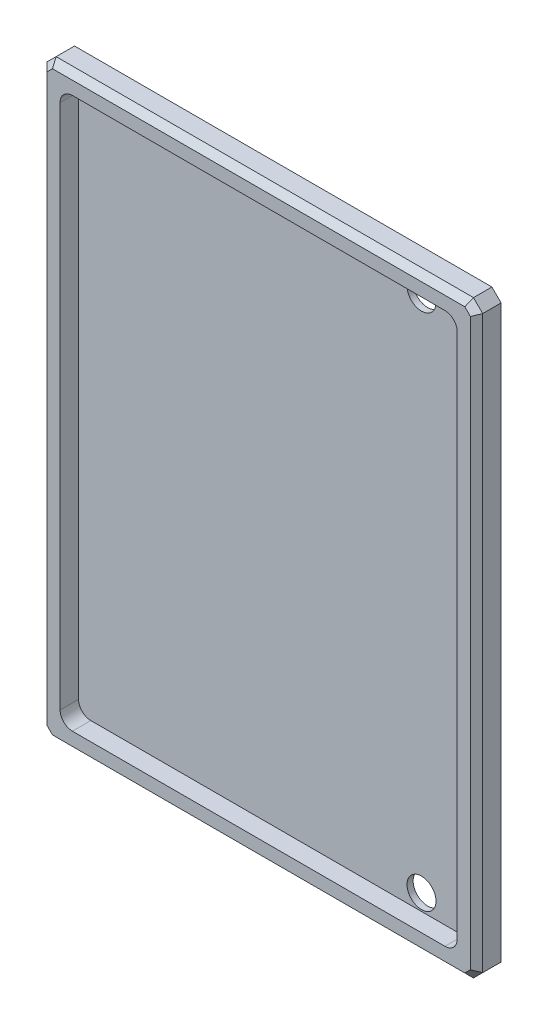
ISO-10303-21;
HEADER;
FILE_DESCRIPTION(('STEP AP214'),'2;1');
FILE_NAME('part.step','',(''),(''),'','','');
FILE_SCHEMA(('AUTOMOTIVE_DESIGN { 1 0 10303 214 1 1 1 1 }'));
ENDSEC;
DATA;
#1=APPLICATION_CONTEXT('core data for automotive mechanical design processes');
#2=APPLICATION_PROTOCOL_DEFINITION('international standard','automotive_design',2000,#1);
#3=PRODUCT_CONTEXT('',#1,'mechanical');
#4=PRODUCT('Part','Part','',(#3));
#5=PRODUCT_RELATED_PRODUCT_CATEGORY('part','',(#4));
#6=PRODUCT_DEFINITION_FORMATION('','',#4);
#7=PRODUCT_DEFINITION_CONTEXT('part definition',#1,'design');
#8=PRODUCT_DEFINITION('design','',#6,#7);
#9=PRODUCT_DEFINITION_SHAPE('','',#8);
#10=(LENGTH_UNIT() NAMED_UNIT(*) SI_UNIT(.MILLI.,.METRE.));
#11=(NAMED_UNIT(*) PLANE_ANGLE_UNIT() SI_UNIT($,.RADIAN.));
#12=(NAMED_UNIT(*) SI_UNIT($,.STERADIAN.) SOLID_ANGLE_UNIT());
#13=UNCERTAINTY_MEASURE_WITH_UNIT(LENGTH_MEASURE(1.E-05),#10,'distance_accuracy_value','');
#14=(GEOMETRIC_REPRESENTATION_CONTEXT(3) GLOBAL_UNCERTAINTY_ASSIGNED_CONTEXT((#13)) GLOBAL_UNIT_ASSIGNED_CONTEXT((#10,
#11,#12)) REPRESENTATION_CONTEXT('',''));
#15=CARTESIAN_POINT('',(0.,0.,0.));
#16=DIRECTION('',(0.,0.,1.));
#17=DIRECTION('',(1.,0.,0.));
#18=AXIS2_PLACEMENT_3D('',#15,#16,#17);
#19=CARTESIAN_POINT('',(-112.7125,-152.4,12.7));
#20=DIRECTION('',(1.,0.,0.));
#21=DIRECTION('',(0.,0.,-1.));
#22=AXIS2_PLACEMENT_3D('',#19,#20,#21);
#23=PLANE('',#22);
#24=DIRECTION('',(0.,0.,1.));
#25=VECTOR('',#24,1.);
#26=CARTESIAN_POINT('',(-112.7125,-147.6375,12.7));
#27=LINE('',#26,#25);
#28=CARTESIAN_POINT('',(-112.7125,-147.6375,0.));
#29=VERTEX_POINT('',#28);
#30=CARTESIAN_POINT('',(-112.7125,-147.6375,9.52499999999996));
#31=VERTEX_POINT('',#30);
#32=EDGE_CURVE('E289',#29,#31,#27,.T.);
#33=ORIENTED_EDGE('',*,*,#32,.T.);
#34=DIRECTION('',(0.,1.,0.));
#35=VECTOR('',#34,1.);
#36=CARTESIAN_POINT('',(-112.7125,147.6375,9.52499999999996));
#37=LINE('',#36,#35);
#38=CARTESIAN_POINT('',(-112.7125,147.6375,9.52499999999996));
#39=VERTEX_POINT('',#38);
#40=EDGE_CURVE('E347',#31,#39,#37,.T.);
#41=ORIENTED_EDGE('',*,*,#40,.T.);
#42=DIRECTION('',(0.,0.,-1.));
#43=VECTOR('',#42,1.);
#44=CARTESIAN_POINT('',(-112.7125,147.6375,12.7));
#45=LINE('',#44,#43);
#46=CARTESIAN_POINT('',(-112.7125,147.6375,0.));
#47=VERTEX_POINT('',#46);
#48=EDGE_CURVE('E295',#39,#47,#45,.T.);
#49=ORIENTED_EDGE('',*,*,#48,.T.);
#50=DIRECTION('',(0.,-1.,0.));
#51=VECTOR('',#50,1.);
#52=CARTESIAN_POINT('',(-112.7125,-152.4,0.));
#53=LINE('',#52,#51);
#54=EDGE_CURVE('E263',#47,#29,#53,.T.);
#55=ORIENTED_EDGE('',*,*,#54,.T.);
#56=EDGE_LOOP('',(#33,#41,#49,#55));
#57=FACE_BOUND('',#56,.T.);
#58=ADVANCED_FACE('F41',(#57),#23,.F.);
#59=CARTESIAN_POINT('',(112.7125,-152.4,12.7));
#60=DIRECTION('',(0.,1.,0.));
#61=DIRECTION('',(0.,0.,1.));
#62=AXIS2_PLACEMENT_3D('',#59,#60,#61);
#63=PLANE('',#62);
#64=DIRECTION('',(0.,0.,1.));
#65=VECTOR('',#64,1.);
#66=CARTESIAN_POINT('',(107.95,-152.4,12.7));
#67=LINE('',#66,#65);
#68=CARTESIAN_POINT('',(107.95,-152.4,0.));
#69=VERTEX_POINT('',#68);
#70=CARTESIAN_POINT('',(107.95,-152.4,9.52499999999996));
#71=VERTEX_POINT('',#70);
#72=EDGE_CURVE('E317',#69,#71,#67,.T.);
#73=ORIENTED_EDGE('',*,*,#72,.T.);
#74=DIRECTION('',(-1.,0.,0.));
#75=VECTOR('',#74,1.);
#76=CARTESIAN_POINT('',(-107.95,-152.4,9.52499999999996));
#77=LINE('',#76,#75);
#78=CARTESIAN_POINT('',(-107.95,-152.4,9.52499999999996));
#79=VERTEX_POINT('',#78);
#80=EDGE_CURVE('E11',#71,#79,#77,.T.);
#81=ORIENTED_EDGE('',*,*,#80,.T.);
#82=DIRECTION('',(0.,0.,-1.));
#83=VECTOR('',#82,1.);
#84=CARTESIAN_POINT('',(-107.95,-152.4,12.7));
#85=LINE('',#84,#83);
#86=CARTESIAN_POINT('',(-107.95,-152.4,0.));
#87=VERTEX_POINT('',#86);
#88=EDGE_CURVE('E315',#79,#87,#85,.T.);
#89=ORIENTED_EDGE('',*,*,#88,.T.);
#90=DIRECTION('',(1.,0.,0.));
#91=VECTOR('',#90,1.);
#92=CARTESIAN_POINT('',(112.7125,-152.4,0.));
#93=LINE('',#92,#91);
#94=EDGE_CURVE('E280',#87,#69,#93,.T.);
#95=ORIENTED_EDGE('',*,*,#94,.T.);
#96=EDGE_LOOP('',(#73,#81,#89,#95));
#97=FACE_BOUND('',#96,.T.);
#98=ADVANCED_FACE('F401',(#97),#63,.F.);
#99=CARTESIAN_POINT('',(112.7125,-152.4,12.7));
#100=DIRECTION('',(-1.,0.,0.));
#101=DIRECTION('',(0.,0.,1.));
#102=AXIS2_PLACEMENT_3D('',#99,#100,#101);
#103=PLANE('',#102);
#104=DIRECTION('',(0.,0.,1.));
#105=VECTOR('',#104,1.);
#106=CARTESIAN_POINT('',(112.7125,147.6375,12.7));
#107=LINE('',#106,#105);
#108=CARTESIAN_POINT('',(112.7125,147.6375,0.));
#109=VERTEX_POINT('',#108);
#110=CARTESIAN_POINT('',(112.7125,147.6375,9.52499999999996));
#111=VERTEX_POINT('',#110);
#112=EDGE_CURVE('E312',#109,#111,#107,.T.);
#113=ORIENTED_EDGE('',*,*,#112,.T.);
#114=DIRECTION('',(0.,-1.,0.));
#115=VECTOR('',#114,1.);
#116=CARTESIAN_POINT('',(112.7125,-147.6375,9.52499999999996));
#117=LINE('',#116,#115);
#118=CARTESIAN_POINT('',(112.7125,-147.6375,9.52499999999996));
#119=VERTEX_POINT('',#118);
#120=EDGE_CURVE('E339',#111,#119,#117,.T.);
#121=ORIENTED_EDGE('',*,*,#120,.T.);
#122=DIRECTION('',(0.,0.,-1.));
#123=VECTOR('',#122,1.);
#124=CARTESIAN_POINT('',(112.7125,-147.6375,12.7));
#125=LINE('',#124,#123);
#126=CARTESIAN_POINT('',(112.7125,-147.6375,0.));
#127=VERTEX_POINT('',#126);
#128=EDGE_CURVE('E310',#119,#127,#125,.T.);
#129=ORIENTED_EDGE('',*,*,#128,.T.);
#130=DIRECTION('',(0.,1.,0.));
#131=VECTOR('',#130,1.);
#132=CARTESIAN_POINT('',(112.7125,-152.4,0.));
#133=LINE('',#132,#131);
#134=EDGE_CURVE('E283',#127,#109,#133,.T.);
#135=ORIENTED_EDGE('',*,*,#134,.T.);
#136=EDGE_LOOP('',(#113,#121,#129,#135));
#137=FACE_BOUND('',#136,.T.);
#138=ADVANCED_FACE('F444',(#137),#103,.F.);
#139=CARTESIAN_POINT('',(112.7125,152.4,12.7));
#140=DIRECTION('',(0.,-1.,0.));
#141=DIRECTION('',(0.,0.,-1.));
#142=AXIS2_PLACEMENT_3D('',#139,#140,#141);
#143=PLANE('',#142);
#144=DIRECTION('',(0.,0.,1.));
#145=VECTOR('',#144,1.);
#146=CARTESIAN_POINT('',(-107.95,152.4,12.7));
#147=LINE('',#146,#145);
#148=CARTESIAN_POINT('',(-107.95,152.4,0.));
#149=VERTEX_POINT('',#148);
#150=CARTESIAN_POINT('',(-107.95,152.4,9.52499999999996));
#151=VERTEX_POINT('',#150);
#152=EDGE_CURVE('E307',#149,#151,#147,.T.);
#153=ORIENTED_EDGE('',*,*,#152,.T.);
#154=DIRECTION('',(1.,0.,0.));
#155=VECTOR('',#154,1.);
#156=CARTESIAN_POINT('',(107.95,152.4,9.52499999999996));
#157=LINE('',#156,#155);
#158=CARTESIAN_POINT('',(107.95,152.4,9.52499999999996));
#159=VERTEX_POINT('',#158);
#160=EDGE_CURVE('E343',#151,#159,#157,.T.);
#161=ORIENTED_EDGE('',*,*,#160,.T.);
#162=DIRECTION('',(0.,0.,-1.));
#163=VECTOR('',#162,1.);
#164=CARTESIAN_POINT('',(107.95,152.4,12.7));
#165=LINE('',#164,#163);
#166=CARTESIAN_POINT('',(107.95,152.4,0.));
#167=VERTEX_POINT('',#166);
#168=EDGE_CURVE('E305',#159,#167,#165,.T.);
#169=ORIENTED_EDGE('',*,*,#168,.T.);
#170=DIRECTION('',(-1.,0.,0.));
#171=VECTOR('',#170,1.);
#172=CARTESIAN_POINT('',(112.7125,152.4,0.));
#173=LINE('',#172,#171);
#174=EDGE_CURVE('E286',#167,#149,#173,.T.);
#175=ORIENTED_EDGE('',*,*,#174,.T.);
#176=EDGE_LOOP('',(#153,#161,#169,#175));
#177=FACE_BOUND('',#176,.T.);
#178=ADVANCED_FACE('F387',(#177),#143,.F.);
#179=CARTESIAN_POINT('',(0.,0.,12.7));
#180=DIRECTION('',(0.,0.,1.));
#181=DIRECTION('',(1.,0.,0.));
#182=AXIS2_PLACEMENT_3D('',#179,#180,#181);
#183=PLANE('',#182);
#184=DIRECTION('',(1.,0.,0.));
#185=VECTOR('',#184,1.);
#186=CARTESIAN_POINT('',(107.95,-149.225,12.7));
#187=LINE('',#186,#185);
#188=CARTESIAN_POINT('',(-106.634871939465,-149.225,12.7));
#189=VERTEX_POINT('',#188);
#190=CARTESIAN_POINT('',(106.634871939465,-149.225,12.7));
#191=VERTEX_POINT('',#190);
#192=EDGE_CURVE('E319',#189,#191,#187,.T.);
#193=ORIENTED_EDGE('',*,*,#192,.T.);
#194=DIRECTION('',(0.707106781186548,0.707106781186548,0.));
#195=VECTOR('',#194,1.);
#196=CARTESIAN_POINT('',(127.929935969733,-127.929935969733,12.7));
#197=LINE('',#196,#195);
#198=CARTESIAN_POINT('',(109.5375,-146.322371939465,12.7));
#199=VERTEX_POINT('',#198);
#200=EDGE_CURVE('E333',#191,#199,#197,.T.);
#201=ORIENTED_EDGE('',*,*,#200,.T.);
#202=DIRECTION('',(0.,1.,0.));
#203=VECTOR('',#202,1.);
#204=CARTESIAN_POINT('',(109.5375,147.6375,12.7));
#205=LINE('',#204,#203);
#206=CARTESIAN_POINT('',(109.5375,146.322371939465,12.7));
#207=VERTEX_POINT('',#206);
#208=EDGE_CURVE('E331',#199,#207,#205,.T.);
#209=ORIENTED_EDGE('',*,*,#208,.T.);
#210=DIRECTION('',(-0.707106781186548,0.707106781186548,0.));
#211=VECTOR('',#210,1.);
#212=CARTESIAN_POINT('',(127.929935969733,127.929935969733,12.7));
#213=LINE('',#212,#211);
#214=CARTESIAN_POINT('',(106.634871939465,149.225,12.7));
#215=VERTEX_POINT('',#214);
#216=EDGE_CURVE('E329',#207,#215,#213,.T.);
#217=ORIENTED_EDGE('',*,*,#216,.T.);
#218=DIRECTION('',(-1.,0.,0.));
#219=VECTOR('',#218,1.);
#220=CARTESIAN_POINT('',(-107.95,149.225,12.7));
#221=LINE('',#220,#219);
#222=CARTESIAN_POINT('',(-106.634871939465,149.225,12.7));
#223=VERTEX_POINT('',#222);
#224=EDGE_CURVE('E327',#215,#223,#221,.T.);
#225=ORIENTED_EDGE('',*,*,#224,.T.);
#226=DIRECTION('',(-0.707106781186552,-0.707106781186543,0.));
#227=VECTOR('',#226,1.);
#228=CARTESIAN_POINT('',(-127.929935969732,127.929935969734,12.7));
#229=LINE('',#228,#227);
#230=CARTESIAN_POINT('',(-109.5375,146.322371939465,12.7));
#231=VERTEX_POINT('',#230);
#232=EDGE_CURVE('E325',#223,#231,#229,.T.);
#233=ORIENTED_EDGE('',*,*,#232,.T.);
#234=DIRECTION('',(0.,-1.,0.));
#235=VECTOR('',#234,1.);
#236=CARTESIAN_POINT('',(-109.5375,-147.6375,12.7));
#237=LINE('',#236,#235);
#238=CARTESIAN_POINT('',(-109.5375,-146.322371939465,12.7));
#239=VERTEX_POINT('',#238);
#240=EDGE_CURVE('E323',#231,#239,#237,.T.);
#241=ORIENTED_EDGE('',*,*,#240,.T.);
#242=DIRECTION('',(0.707106781186548,-0.707106781186548,0.));
#243=VECTOR('',#242,1.);
#244=CARTESIAN_POINT('',(-127.929935969733,-127.929935969733,12.7));
#245=LINE('',#244,#243);
#246=EDGE_CURVE('E321',#239,#189,#245,.T.);
#247=ORIENTED_EDGE('',*,*,#246,.T.);
#248=EDGE_LOOP('',(#193,#201,#209,#217,#225,#233,#241,#247));
#249=FACE_BOUND('',#248,.T.);
#250=CARTESIAN_POINT('',(-96.3625,-136.05,12.7));
#251=DIRECTION('',(0.,0.,1.));
#252=DIRECTION('',(-1.,0.,0.));
#253=AXIS2_PLACEMENT_3D('',#250,#251,#252);
#254=CIRCLE('',#253,6.34999999999999);
#255=CARTESIAN_POINT('',(-102.7125,-136.05,12.7));
#256=VERTEX_POINT('',#255);
#257=CARTESIAN_POINT('',(-96.3625,-142.4,12.7));
#258=VERTEX_POINT('',#257);
#259=EDGE_CURVE('E238',#256,#258,#254,.T.);
#260=ORIENTED_EDGE('',*,*,#259,.F.);
#261=DIRECTION('',(0.,-1.,0.));
#262=VECTOR('',#261,1.);
#263=CARTESIAN_POINT('',(-102.7125,-136.05,12.7));
#264=LINE('',#263,#262);
#265=CARTESIAN_POINT('',(-102.7125,136.05,12.7));
#266=VERTEX_POINT('',#265);
#267=EDGE_CURVE('E216',#266,#256,#264,.T.);
#268=ORIENTED_EDGE('',*,*,#267,.F.);
#269=CARTESIAN_POINT('',(-96.3625,136.05,12.7));
#270=DIRECTION('',(0.,0.,1.));
#271=DIRECTION('',(1.,0.,0.));
#272=AXIS2_PLACEMENT_3D('',#269,#270,#271);
#273=CIRCLE('',#272,6.34999999999999);
#274=CARTESIAN_POINT('',(-96.3625,142.4,12.7));
#275=VERTEX_POINT('',#274);
#276=EDGE_CURVE('E256',#275,#266,#273,.T.);
#277=ORIENTED_EDGE('',*,*,#276,.F.);
#278=DIRECTION('',(-1.,0.,0.));
#279=VECTOR('',#278,1.);
#280=CARTESIAN_POINT('',(96.3625,142.4,12.7));
#281=LINE('',#280,#279);
#282=CARTESIAN_POINT('',(96.3625,142.4,12.7));
#283=VERTEX_POINT('',#282);
#284=EDGE_CURVE('E253',#283,#275,#281,.T.);
#285=ORIENTED_EDGE('',*,*,#284,.F.);
#286=CARTESIAN_POINT('',(96.3625,136.05,12.7));
#287=DIRECTION('',(0.,0.,1.));
#288=DIRECTION('',(1.,0.,0.));
#289=AXIS2_PLACEMENT_3D('',#286,#287,#288);
#290=CIRCLE('',#289,6.34999999999999);
#291=CARTESIAN_POINT('',(102.7125,136.05,12.7));
#292=VERTEX_POINT('',#291);
#293=EDGE_CURVE('E250',#292,#283,#290,.T.);
#294=ORIENTED_EDGE('',*,*,#293,.F.);
#295=DIRECTION('',(0.,1.,0.));
#296=VECTOR('',#295,1.);
#297=CARTESIAN_POINT('',(102.7125,-136.05,12.7));
#298=LINE('',#297,#296);
#299=CARTESIAN_POINT('',(102.7125,-136.05,12.7));
#300=VERTEX_POINT('',#299);
#301=EDGE_CURVE('E247',#300,#292,#298,.T.);
#302=ORIENTED_EDGE('',*,*,#301,.F.);
#303=CARTESIAN_POINT('',(96.3625,-136.05,12.7));
#304=DIRECTION('',(0.,0.,1.));
#305=DIRECTION('',(1.,0.,0.));
#306=AXIS2_PLACEMENT_3D('',#303,#304,#305);
#307=CIRCLE('',#306,6.34999999999999);
#308=CARTESIAN_POINT('',(96.3625,-142.4,12.7));
#309=VERTEX_POINT('',#308);
#310=EDGE_CURVE('E244',#309,#300,#307,.T.);
#311=ORIENTED_EDGE('',*,*,#310,.F.);
#312=DIRECTION('',(1.,0.,0.));
#313=VECTOR('',#312,1.);
#314=CARTESIAN_POINT('',(96.3625,-142.4,12.7));
#315=LINE('',#314,#313);
#316=EDGE_CURVE('E240',#258,#309,#315,.T.);
#317=ORIENTED_EDGE('',*,*,#316,.F.);
#318=EDGE_LOOP('',(#260,#268,#277,#285,#294,#302,#311,#317));
#319=FACE_BOUND('',#318,.T.);
#320=ADVANCED_FACE('F418',(#249,#319),#183,.T.);
#321=CARTESIAN_POINT('',(0.,0.,0.));
#322=DIRECTION('',(0.,0.,1.));
#323=DIRECTION('',(1.,0.,0.));
#324=AXIS2_PLACEMENT_3D('',#321,#322,#323);
#325=PLANE('',#324);
#326=CARTESIAN_POINT('',(-107.7125,-113.6,0.));
#327=DIRECTION('',(0.,0.,-1.));
#328=DIRECTION('',(-1.,0.,0.));
#329=AXIS2_PLACEMENT_3D('',#326,#327,#328);
#330=CIRCLE('',#329,1.65);
#331=CARTESIAN_POINT('',(-109.3625,-113.6,0.));
#332=VERTEX_POINT('',#331);
#333=EDGE_CURVE('E195',#332,#332,#330,.T.);
#334=ORIENTED_EDGE('',*,*,#333,.F.);
#335=EDGE_LOOP('',(#334));
#336=FACE_BOUND('',#335,.T.);
#337=CARTESIAN_POINT('',(-107.7125,113.6,0.));
#338=DIRECTION('',(0.,0.,-1.));
#339=DIRECTION('',(-1.,0.,0.));
#340=AXIS2_PLACEMENT_3D('',#337,#338,#339);
#341=CIRCLE('',#340,1.65);
#342=CARTESIAN_POINT('',(-109.3625,113.6,0.));
#343=VERTEX_POINT('',#342);
#344=EDGE_CURVE('E194',#343,#343,#341,.T.);
#345=ORIENTED_EDGE('',*,*,#344,.F.);
#346=EDGE_LOOP('',(#345));
#347=FACE_BOUND('',#346,.T.);
#348=CARTESIAN_POINT('',(74.7125,-134.05,0.));
#349=DIRECTION('',(0.,0.,-1.));
#350=DIRECTION('',(-1.,0.,0.));
#351=AXIS2_PLACEMENT_3D('',#348,#349,#350);
#352=CIRCLE('',#351,7.50000000000001);
#353=CARTESIAN_POINT('',(67.2125,-134.05,0.));
#354=VERTEX_POINT('',#353);
#355=EDGE_CURVE('E206',#354,#354,#352,.T.);
#356=ORIENTED_EDGE('',*,*,#355,.F.);
#357=EDGE_LOOP('',(#356));
#358=FACE_BOUND('',#357,.T.);
#359=CARTESIAN_POINT('',(74.7125,134.05,0.));
#360=DIRECTION('',(0.,0.,-1.));
#361=DIRECTION('',(1.,0.,0.));
#362=AXIS2_PLACEMENT_3D('',#359,#360,#361);
#363=CIRCLE('',#362,7.50000000000001);
#364=CARTESIAN_POINT('',(82.2125000000001,134.05,0.));
#365=VERTEX_POINT('',#364);
#366=EDGE_CURVE('E205',#365,#365,#363,.T.);
#367=ORIENTED_EDGE('',*,*,#366,.F.);
#368=EDGE_LOOP('',(#367));
#369=FACE_BOUND('',#368,.T.);
#370=ORIENTED_EDGE('',*,*,#54,.F.);
#371=DIRECTION('',(-0.707106781186552,-0.707106781186543,0.));
#372=VECTOR('',#371,1.);
#373=CARTESIAN_POINT('',(-112.7125,147.6375,0.));
#374=LINE('',#373,#372);
#375=EDGE_CURVE('E303',#47,#149,#374,.F.);
#376=ORIENTED_EDGE('',*,*,#375,.T.);
#377=ORIENTED_EDGE('',*,*,#174,.F.);
#378=DIRECTION('',(-0.707106781186548,0.707106781186548,0.));
#379=VECTOR('',#378,1.);
#380=CARTESIAN_POINT('',(107.95,152.4,0.));
#381=LINE('',#380,#379);
#382=EDGE_CURVE('E301',#167,#109,#381,.F.);
#383=ORIENTED_EDGE('',*,*,#382,.T.);
#384=ORIENTED_EDGE('',*,*,#134,.F.);
#385=DIRECTION('',(0.707106781186548,0.707106781186548,0.));
#386=VECTOR('',#385,1.);
#387=CARTESIAN_POINT('',(112.7125,-147.6375,0.));
#388=LINE('',#387,#386);
#389=EDGE_CURVE('E299',#127,#69,#388,.F.);
#390=ORIENTED_EDGE('',*,*,#389,.T.);
#391=ORIENTED_EDGE('',*,*,#94,.F.);
#392=DIRECTION('',(0.707106781186548,-0.707106781186548,0.));
#393=VECTOR('',#392,1.);
#394=CARTESIAN_POINT('',(-107.95,-152.4,0.));
#395=LINE('',#394,#393);
#396=EDGE_CURVE('E297',#87,#29,#395,.F.);
#397=ORIENTED_EDGE('',*,*,#396,.T.);
#398=EDGE_LOOP('',(#370,#376,#377,#383,#384,#390,#391,#397));
#399=FACE_BOUND('',#398,.T.);
#400=ADVANCED_FACE('F393',(#336,#347,#358,#369,#399),#325,.F.);
#401=CARTESIAN_POINT('',(-96.3625,-136.05,3.175));
#402=DIRECTION('',(0.,0.,1.));
#403=DIRECTION('',(1.,0.,0.));
#404=AXIS2_PLACEMENT_3D('',#401,#402,#403);
#405=CYLINDRICAL_SURFACE('',#404,6.34999999999999);
#406=ORIENTED_EDGE('',*,*,#259,.T.);
#407=DIRECTION('',(0.,0.,1.));
#408=VECTOR('',#407,1.);
#409=CARTESIAN_POINT('',(-96.3625,-142.4,3.175));
#410=LINE('',#409,#408);
#411=CARTESIAN_POINT('',(-96.3625,-142.4,3.175));
#412=VERTEX_POINT('',#411);
#413=EDGE_CURVE('E237',#412,#258,#410,.T.);
#414=ORIENTED_EDGE('',*,*,#413,.F.);
#415=CARTESIAN_POINT('',(-96.3625,-136.05,3.175));
#416=DIRECTION('',(0.,0.,1.));
#417=DIRECTION('',(-1.,0.,0.));
#418=AXIS2_PLACEMENT_3D('',#415,#416,#417);
#419=CIRCLE('',#418,6.34999999999999);
#420=CARTESIAN_POINT('',(-102.7125,-136.05,3.175));
#421=VERTEX_POINT('',#420);
#422=EDGE_CURVE('E212',#421,#412,#419,.T.);
#423=ORIENTED_EDGE('',*,*,#422,.F.);
#424=DIRECTION('',(0.,0.,1.));
#425=VECTOR('',#424,1.);
#426=CARTESIAN_POINT('',(-102.7125,-136.05,3.175));
#427=LINE('',#426,#425);
#428=EDGE_CURVE('E261',#421,#256,#427,.T.);
#429=ORIENTED_EDGE('',*,*,#428,.T.);
#430=EDGE_LOOP('',(#406,#414,#423,#429));
#431=FACE_BOUND('',#430,.T.);
#432=ADVANCED_FACE('F628',(#431),#405,.F.);
#433=CARTESIAN_POINT('',(-102.7125,-136.05,3.175));
#434=DIRECTION('',(-1.,0.,0.));
#435=DIRECTION('',(0.,-1.,0.));
#436=AXIS2_PLACEMENT_3D('',#433,#434,#435);
#437=PLANE('',#436);
#438=ORIENTED_EDGE('',*,*,#267,.T.);
#439=ORIENTED_EDGE('',*,*,#428,.F.);
#440=DIRECTION('',(0.,-1.,0.));
#441=VECTOR('',#440,1.);
#442=CARTESIAN_POINT('',(-102.7125,-136.05,3.175));
#443=LINE('',#442,#441);
#444=CARTESIAN_POINT('',(-102.7125,136.05,3.175));
#445=VERTEX_POINT('',#444);
#446=EDGE_CURVE('E234',#445,#421,#443,.T.);
#447=ORIENTED_EDGE('',*,*,#446,.F.);
#448=DIRECTION('',(0.,0.,1.));
#449=VECTOR('',#448,1.);
#450=CARTESIAN_POINT('',(-102.7125,136.05,3.175));
#451=LINE('',#450,#449);
#452=EDGE_CURVE('E264',#445,#266,#451,.T.);
#453=ORIENTED_EDGE('',*,*,#452,.T.);
#454=EDGE_LOOP('',(#438,#439,#447,#453));
#455=FACE_BOUND('',#454,.T.);
#456=ADVANCED_FACE('F620',(#455),#437,.F.);
#457=CARTESIAN_POINT('',(-96.3625,136.05,3.175));
#458=DIRECTION('',(0.,0.,1.));
#459=DIRECTION('',(1.,0.,0.));
#460=AXIS2_PLACEMENT_3D('',#457,#458,#459);
#461=CYLINDRICAL_SURFACE('',#460,6.34999999999999);
#462=ORIENTED_EDGE('',*,*,#276,.T.);
#463=ORIENTED_EDGE('',*,*,#452,.F.);
#464=CARTESIAN_POINT('',(-96.3625,136.05,3.175));
#465=DIRECTION('',(0.,0.,1.));
#466=DIRECTION('',(1.,0.,0.));
#467=AXIS2_PLACEMENT_3D('',#464,#465,#466);
#468=CIRCLE('',#467,6.34999999999999);
#469=CARTESIAN_POINT('',(-96.3625,142.4,3.175));
#470=VERTEX_POINT('',#469);
#471=EDGE_CURVE('E231',#470,#445,#468,.T.);
#472=ORIENTED_EDGE('',*,*,#471,.F.);
#473=DIRECTION('',(0.,0.,1.));
#474=VECTOR('',#473,1.);
#475=CARTESIAN_POINT('',(-96.3625,142.4,3.175));
#476=LINE('',#475,#474);
#477=EDGE_CURVE('E266',#470,#275,#476,.T.);
#478=ORIENTED_EDGE('',*,*,#477,.T.);
#479=EDGE_LOOP('',(#462,#463,#472,#478));
#480=FACE_BOUND('',#479,.T.);
#481=ADVANCED_FACE('F612',(#480),#461,.F.);
#482=CARTESIAN_POINT('',(96.3625,142.4,3.175));
#483=DIRECTION('',(0.,1.,0.));
#484=DIRECTION('',(0.,0.,1.));
#485=AXIS2_PLACEMENT_3D('',#482,#483,#484);
#486=PLANE('',#485);
#487=ORIENTED_EDGE('',*,*,#284,.T.);
#488=ORIENTED_EDGE('',*,*,#477,.F.);
#489=DIRECTION('',(-1.,0.,0.));
#490=VECTOR('',#489,1.);
#491=CARTESIAN_POINT('',(96.3625,142.4,3.175));
#492=LINE('',#491,#490);
#493=CARTESIAN_POINT('',(96.3625,142.4,3.175));
#494=VERTEX_POINT('',#493);
#495=EDGE_CURVE('E228',#494,#470,#492,.T.);
#496=ORIENTED_EDGE('',*,*,#495,.F.);
#497=DIRECTION('',(0.,0.,1.));
#498=VECTOR('',#497,1.);
#499=CARTESIAN_POINT('',(96.3625,142.4,3.175));
#500=LINE('',#499,#498);
#501=EDGE_CURVE('E268',#494,#283,#500,.T.);
#502=ORIENTED_EDGE('',*,*,#501,.T.);
#503=EDGE_LOOP('',(#487,#488,#496,#502));
#504=FACE_BOUND('',#503,.T.);
#505=ADVANCED_FACE('F604',(#504),#486,.F.);
#506=CARTESIAN_POINT('',(96.3625,136.05,3.175));
#507=DIRECTION('',(0.,0.,1.));
#508=DIRECTION('',(1.,0.,0.));
#509=AXIS2_PLACEMENT_3D('',#506,#507,#508);
#510=CYLINDRICAL_SURFACE('',#509,6.34999999999999);
#511=ORIENTED_EDGE('',*,*,#293,.T.);
#512=ORIENTED_EDGE('',*,*,#501,.F.);
#513=CARTESIAN_POINT('',(96.3625,136.05,3.175));
#514=DIRECTION('',(0.,0.,1.));
#515=DIRECTION('',(1.,0.,0.));
#516=AXIS2_PLACEMENT_3D('',#513,#514,#515);
#517=CIRCLE('',#516,6.34999999999999);
#518=CARTESIAN_POINT('',(102.7125,136.05,3.175));
#519=VERTEX_POINT('',#518);
#520=EDGE_CURVE('E225',#519,#494,#517,.T.);
#521=ORIENTED_EDGE('',*,*,#520,.F.);
#522=DIRECTION('',(0.,0.,1.));
#523=VECTOR('',#522,1.);
#524=CARTESIAN_POINT('',(102.7125,136.05,3.175));
#525=LINE('',#524,#523);
#526=EDGE_CURVE('E270',#519,#292,#525,.T.);
#527=ORIENTED_EDGE('',*,*,#526,.T.);
#528=EDGE_LOOP('',(#511,#512,#521,#527));
#529=FACE_BOUND('',#528,.T.);
#530=ADVANCED_FACE('F596',(#529),#510,.F.);
#531=CARTESIAN_POINT('',(102.7125,-136.05,3.175));
#532=DIRECTION('',(1.,0.,0.));
#533=DIRECTION('',(0.,0.,-1.));
#534=AXIS2_PLACEMENT_3D('',#531,#532,#533);
#535=PLANE('',#534);
#536=ORIENTED_EDGE('',*,*,#301,.T.);
#537=ORIENTED_EDGE('',*,*,#526,.F.);
#538=DIRECTION('',(0.,1.,0.));
#539=VECTOR('',#538,1.);
#540=CARTESIAN_POINT('',(102.7125,-136.05,3.175));
#541=LINE('',#540,#539);
#542=CARTESIAN_POINT('',(102.7125,-136.05,3.175));
#543=VERTEX_POINT('',#542);
#544=EDGE_CURVE('E222',#543,#519,#541,.T.);
#545=ORIENTED_EDGE('',*,*,#544,.F.);
#546=DIRECTION('',(0.,0.,1.));
#547=VECTOR('',#546,1.);
#548=CARTESIAN_POINT('',(102.7125,-136.05,3.175));
#549=LINE('',#548,#547);
#550=EDGE_CURVE('E272',#543,#300,#549,.T.);
#551=ORIENTED_EDGE('',*,*,#550,.T.);
#552=EDGE_LOOP('',(#536,#537,#545,#551));
#553=FACE_BOUND('',#552,.T.);
#554=ADVANCED_FACE('F588',(#553),#535,.F.);
#555=CARTESIAN_POINT('',(96.3625,-136.05,3.175));
#556=DIRECTION('',(0.,0.,1.));
#557=DIRECTION('',(1.,0.,0.));
#558=AXIS2_PLACEMENT_3D('',#555,#556,#557);
#559=CYLINDRICAL_SURFACE('',#558,6.34999999999999);
#560=ORIENTED_EDGE('',*,*,#310,.T.);
#561=ORIENTED_EDGE('',*,*,#550,.F.);
#562=CARTESIAN_POINT('',(96.3625,-136.05,3.175));
#563=DIRECTION('',(0.,0.,1.));
#564=DIRECTION('',(1.,0.,0.));
#565=AXIS2_PLACEMENT_3D('',#562,#563,#564);
#566=CIRCLE('',#565,6.34999999999999);
#567=CARTESIAN_POINT('',(96.3625,-142.4,3.175));
#568=VERTEX_POINT('',#567);
#569=EDGE_CURVE('E219',#568,#543,#566,.T.);
#570=ORIENTED_EDGE('',*,*,#569,.F.);
#571=DIRECTION('',(0.,0.,1.));
#572=VECTOR('',#571,1.);
#573=CARTESIAN_POINT('',(96.3625,-142.4,3.175));
#574=LINE('',#573,#572);
#575=EDGE_CURVE('E274',#568,#309,#574,.T.);
#576=ORIENTED_EDGE('',*,*,#575,.T.);
#577=EDGE_LOOP('',(#560,#561,#570,#576));
#578=FACE_BOUND('',#577,.T.);
#579=ADVANCED_FACE('F580',(#578),#559,.F.);
#580=CARTESIAN_POINT('',(96.3625,-142.4,3.175));
#581=DIRECTION('',(0.,-1.,0.));
#582=DIRECTION('',(0.,0.,-1.));
#583=AXIS2_PLACEMENT_3D('',#580,#581,#582);
#584=PLANE('',#583);
#585=ORIENTED_EDGE('',*,*,#316,.T.);
#586=ORIENTED_EDGE('',*,*,#575,.F.);
#587=DIRECTION('',(1.,0.,0.));
#588=VECTOR('',#587,1.);
#589=CARTESIAN_POINT('',(96.3625,-142.4,3.175));
#590=LINE('',#589,#588);
#591=EDGE_CURVE('E215',#412,#568,#590,.T.);
#592=ORIENTED_EDGE('',*,*,#591,.F.);
#593=ORIENTED_EDGE('',*,*,#413,.T.);
#594=EDGE_LOOP('',(#585,#586,#592,#593));
#595=FACE_BOUND('',#594,.T.);
#596=ADVANCED_FACE('F572',(#595),#584,.F.);
#597=CARTESIAN_POINT('',(-96.3625,-136.05,3.175));
#598=DIRECTION('',(0.,0.,-1.));
#599=DIRECTION('',(-1.,0.,0.));
#600=AXIS2_PLACEMENT_3D('',#597,#598,#599);
#601=PLANE('',#600);
#602=CARTESIAN_POINT('',(74.7125,-134.05,3.175));
#603=DIRECTION('',(0.,0.,-1.));
#604=DIRECTION('',(-1.,0.,0.));
#605=AXIS2_PLACEMENT_3D('',#602,#603,#604);
#606=CIRCLE('',#605,7.50000000000001);
#607=CARTESIAN_POINT('',(67.2125,-134.05,3.175));
#608=VERTEX_POINT('',#607);
#609=EDGE_CURVE('E241',#608,#608,#606,.T.);
#610=ORIENTED_EDGE('',*,*,#609,.T.);
#611=EDGE_LOOP('',(#610));
#612=FACE_BOUND('',#611,.T.);
#613=CARTESIAN_POINT('',(74.7125,134.05,3.175));
#614=DIRECTION('',(0.,0.,-1.));
#615=DIRECTION('',(-1.,0.,0.));
#616=AXIS2_PLACEMENT_3D('',#613,#614,#615);
#617=CIRCLE('',#616,7.50000000000001);
#618=CARTESIAN_POINT('',(67.2125,134.05,3.175));
#619=VERTEX_POINT('',#618);
#620=EDGE_CURVE('E209',#619,#619,#617,.T.);
#621=ORIENTED_EDGE('',*,*,#620,.T.);
#622=EDGE_LOOP('',(#621));
#623=FACE_BOUND('',#622,.T.);
#624=ORIENTED_EDGE('',*,*,#422,.T.);
#625=ORIENTED_EDGE('',*,*,#591,.T.);
#626=ORIENTED_EDGE('',*,*,#569,.T.);
#627=ORIENTED_EDGE('',*,*,#544,.T.);
#628=ORIENTED_EDGE('',*,*,#520,.T.);
#629=ORIENTED_EDGE('',*,*,#495,.T.);
#630=ORIENTED_EDGE('',*,*,#471,.T.);
#631=ORIENTED_EDGE('',*,*,#446,.T.);
#632=EDGE_LOOP('',(#624,#625,#626,#627,#628,#629,#630,#631));
#633=FACE_BOUND('',#632,.T.);
#634=ADVANCED_FACE('F563',(#612,#623,#633),#601,.F.);
#635=CARTESIAN_POINT('',(74.7125,134.05,12.7));
#636=DIRECTION('',(0.,0.,-1.));
#637=DIRECTION('',(-1.,0.,0.));
#638=AXIS2_PLACEMENT_3D('',#635,#636,#637);
#639=CYLINDRICAL_SURFACE('',#638,7.50000000000001);
#640=ORIENTED_EDGE('',*,*,#366,.T.);
#641=EDGE_LOOP('',(#640));
#642=FACE_BOUND('',#641,.T.);
#643=ORIENTED_EDGE('',*,*,#620,.F.);
#644=EDGE_LOOP('',(#643));
#645=FACE_BOUND('',#644,.T.);
#646=ADVANCED_FACE('F555',(#642,#645),#639,.F.);
#647=CARTESIAN_POINT('',(74.7125,-134.05,12.7));
#648=DIRECTION('',(0.,0.,-1.));
#649=DIRECTION('',(-1.,0.,0.));
#650=AXIS2_PLACEMENT_3D('',#647,#648,#649);
#651=CYLINDRICAL_SURFACE('',#650,7.50000000000001);
#652=ORIENTED_EDGE('',*,*,#355,.T.);
#653=EDGE_LOOP('',(#652));
#654=FACE_BOUND('',#653,.T.);
#655=ORIENTED_EDGE('',*,*,#609,.F.);
#656=EDGE_LOOP('',(#655));
#657=FACE_BOUND('',#656,.T.);
#658=ADVANCED_FACE('F547',(#654,#657),#651,.F.);
#659=CARTESIAN_POINT('',(-107.7125,113.6,8.));
#660=DIRECTION('',(0.,0.,-1.));
#661=DIRECTION('',(-1.,0.,0.));
#662=AXIS2_PLACEMENT_3D('',#659,#660,#661);
#663=CONICAL_SURFACE('',#662,1.65,1.02974425867665);
#664=CARTESIAN_POINT('',(-107.7125,113.6,8.99142002139548));
#665=VERTEX_POINT('',#664);
#666=VERTEX_LOOP('',#665);
#667=FACE_BOUND('',#666,.T.);
#668=CARTESIAN_POINT('',(-107.7125,113.6,8.));
#669=DIRECTION('',(0.,0.,-1.));
#670=DIRECTION('',(-1.,0.,0.));
#671=AXIS2_PLACEMENT_3D('',#668,#669,#670);
#672=CIRCLE('',#671,1.65);
#673=CARTESIAN_POINT('',(-109.3625,113.6,8.));
#674=VERTEX_POINT('',#673);
#675=EDGE_CURVE('E198',#674,#674,#672,.T.);
#676=ORIENTED_EDGE('',*,*,#675,.T.);
#677=EDGE_LOOP('',(#676));
#678=FACE_BOUND('',#677,.T.);
#679=ADVANCED_FACE('F538',(#667,#678),#663,.F.);
#680=CARTESIAN_POINT('',(-107.7125,113.6,0.));
#681=DIRECTION('',(0.,0.,-1.));
#682=DIRECTION('',(-1.,0.,0.));
#683=AXIS2_PLACEMENT_3D('',#680,#681,#682);
#684=CYLINDRICAL_SURFACE('',#683,1.65);
#685=ORIENTED_EDGE('',*,*,#675,.F.);
#686=EDGE_LOOP('',(#685));
#687=FACE_BOUND('',#686,.T.);
#688=ORIENTED_EDGE('',*,*,#344,.T.);
#689=EDGE_LOOP('',(#688));
#690=FACE_BOUND('',#689,.T.);
#691=ADVANCED_FACE('F188',(#687,#690),#684,.F.);
#692=CARTESIAN_POINT('',(-107.7125,-113.6,8.));
#693=DIRECTION('',(0.,0.,-1.));
#694=DIRECTION('',(-1.,0.,0.));
#695=AXIS2_PLACEMENT_3D('',#692,#693,#694);
#696=CONICAL_SURFACE('',#695,1.65,1.02974425867665);
#697=CARTESIAN_POINT('',(-107.7125,-113.6,8.99142002139548));
#698=VERTEX_POINT('',#697);
#699=VERTEX_LOOP('',#698);
#700=FACE_BOUND('',#699,.T.);
#701=CARTESIAN_POINT('',(-107.7125,-113.6,8.));
#702=DIRECTION('',(0.,0.,-1.));
#703=DIRECTION('',(-1.,0.,0.));
#704=AXIS2_PLACEMENT_3D('',#701,#702,#703);
#705=CIRCLE('',#704,1.65);
#706=CARTESIAN_POINT('',(-109.3625,-113.6,8.));
#707=VERTEX_POINT('',#706);
#708=EDGE_CURVE('E192',#707,#707,#705,.T.);
#709=ORIENTED_EDGE('',*,*,#708,.T.);
#710=EDGE_LOOP('',(#709));
#711=FACE_BOUND('',#710,.T.);
#712=ADVANCED_FACE('F184',(#700,#711),#696,.F.);
#713=CARTESIAN_POINT('',(-107.7125,-113.6,0.));
#714=DIRECTION('',(0.,0.,-1.));
#715=DIRECTION('',(-1.,0.,0.));
#716=AXIS2_PLACEMENT_3D('',#713,#714,#715);
#717=CYLINDRICAL_SURFACE('',#716,1.65);
#718=ORIENTED_EDGE('',*,*,#708,.F.);
#719=EDGE_LOOP('',(#718));
#720=FACE_BOUND('',#719,.T.);
#721=ORIENTED_EDGE('',*,*,#333,.T.);
#722=EDGE_LOOP('',(#721));
#723=FACE_BOUND('',#722,.T.);
#724=ADVANCED_FACE('F187',(#720,#723),#717,.F.);
#725=CARTESIAN_POINT('',(-112.7125,147.6375,12.7));
#726=DIRECTION('',(0.707106781186543,-0.707106781186552,0.));
#727=DIRECTION('',(0.,0.,-1.));
#728=AXIS2_PLACEMENT_3D('',#725,#726,#727);
#729=PLANE('',#728);
#730=ORIENTED_EDGE('',*,*,#48,.F.);
#731=DIRECTION('',(-0.707106781186552,-0.707106781186543,0.));
#732=VECTOR('',#731,1.);
#733=CARTESIAN_POINT('',(-112.7125,147.6375,9.52499999999996));
#734=LINE('',#733,#732);
#735=EDGE_CURVE('E345',#39,#151,#734,.F.);
#736=ORIENTED_EDGE('',*,*,#735,.T.);
#737=ORIENTED_EDGE('',*,*,#152,.F.);
#738=ORIENTED_EDGE('',*,*,#375,.F.);
#739=EDGE_LOOP('',(#730,#736,#737,#738));
#740=FACE_BOUND('',#739,.T.);
#741=ADVANCED_FACE('F384',(#740),#729,.F.);
#742=CARTESIAN_POINT('',(107.95,152.4,12.7));
#743=DIRECTION('',(-0.707106781186547,-0.707106781186547,0.));
#744=DIRECTION('',(0.,0.,-1.));
#745=AXIS2_PLACEMENT_3D('',#742,#743,#744);
#746=PLANE('',#745);
#747=ORIENTED_EDGE('',*,*,#168,.F.);
#748=DIRECTION('',(-0.707106781186548,0.707106781186548,0.));
#749=VECTOR('',#748,1.);
#750=CARTESIAN_POINT('',(107.95,152.4,9.52499999999996));
#751=LINE('',#750,#749);
#752=EDGE_CURVE('E341',#159,#111,#751,.F.);
#753=ORIENTED_EDGE('',*,*,#752,.T.);
#754=ORIENTED_EDGE('',*,*,#112,.F.);
#755=ORIENTED_EDGE('',*,*,#382,.F.);
#756=EDGE_LOOP('',(#747,#753,#754,#755));
#757=FACE_BOUND('',#756,.T.);
#758=ADVANCED_FACE('F454',(#757),#746,.F.);
#759=CARTESIAN_POINT('',(112.7125,-147.6375,12.7));
#760=DIRECTION('',(-0.707106781186547,0.707106781186547,0.));
#761=DIRECTION('',(0.,0.,-1.));
#762=AXIS2_PLACEMENT_3D('',#759,#760,#761);
#763=PLANE('',#762);
#764=ORIENTED_EDGE('',*,*,#128,.F.);
#765=DIRECTION('',(0.707106781186548,0.707106781186548,0.));
#766=VECTOR('',#765,1.);
#767=CARTESIAN_POINT('',(112.7125,-147.6375,9.52499999999996));
#768=LINE('',#767,#766);
#769=EDGE_CURVE('E336',#119,#71,#768,.F.);
#770=ORIENTED_EDGE('',*,*,#769,.T.);
#771=ORIENTED_EDGE('',*,*,#72,.F.);
#772=ORIENTED_EDGE('',*,*,#389,.F.);
#773=EDGE_LOOP('',(#764,#770,#771,#772));
#774=FACE_BOUND('',#773,.T.);
#775=ADVANCED_FACE('F404',(#774),#763,.F.);
#776=CARTESIAN_POINT('',(-107.95,-152.4,12.7));
#777=DIRECTION('',(0.707106781186547,0.707106781186547,0.));
#778=DIRECTION('',(0.,0.,-1.));
#779=AXIS2_PLACEMENT_3D('',#776,#777,#778);
#780=PLANE('',#779);
#781=ORIENTED_EDGE('',*,*,#88,.F.);
#782=DIRECTION('',(0.707106781186548,-0.707106781186548,0.));
#783=VECTOR('',#782,1.);
#784=CARTESIAN_POINT('',(-107.95,-152.4,9.52499999999996));
#785=LINE('',#784,#783);
#786=EDGE_CURVE('E51',#79,#31,#785,.F.);
#787=ORIENTED_EDGE('',*,*,#786,.T.);
#788=ORIENTED_EDGE('',*,*,#32,.F.);
#789=ORIENTED_EDGE('',*,*,#396,.F.);
#790=EDGE_LOOP('',(#781,#787,#788,#789));
#791=FACE_BOUND('',#790,.T.);
#792=ADVANCED_FACE('F398',(#791),#780,.F.);
#793=CARTESIAN_POINT('',(-127.929935969732,127.929935969734,12.7));
#794=DIRECTION('',(-0.499999999999997,0.500000000000002,0.707106781186548));
#795=DIRECTION('',(0.707106781186552,0.707106781186543,0.));
#796=AXIS2_PLACEMENT_3D('',#793,#794,#795);
#797=PLANE('',#796);
#798=DIRECTION('',(-0.28108463771482,0.678598344545847,-0.678598344545847));
#799=VECTOR('',#798,1.);
#800=CARTESIAN_POINT('',(-104.255468039447,143.480610834212,18.4443891657877));
#801=LINE('',#800,#799);
#802=EDGE_CURVE('E365',#151,#223,#801,.F.);
#803=ORIENTED_EDGE('',*,*,#802,.F.);
#804=ORIENTED_EDGE('',*,*,#735,.F.);
#805=DIRECTION('',(-0.678598344545846,0.281084637714824,-0.678598344545846));
#806=VECTOR('',#805,1.);
#807=CARTESIAN_POINT('',(-81.627448430193,134.761650052719,40.6100515698069));
#808=LINE('',#807,#806);
#809=EDGE_CURVE('E46',#231,#39,#808,.T.);
#810=ORIENTED_EDGE('',*,*,#809,.F.);
#811=ORIENTED_EDGE('',*,*,#232,.F.);
#812=EDGE_LOOP('',(#803,#804,#810,#811));
#813=FACE_BOUND('',#812,.T.);
#814=ADVANCED_FACE('F44',(#813),#797,.T.);
#815=CARTESIAN_POINT('',(-109.5375,0.,12.7));
#816=DIRECTION('',(-0.707106781186548,0.,0.707106781186548));
#817=DIRECTION('',(0.,1.,0.));
#818=AXIS2_PLACEMENT_3D('',#815,#816,#817);
#819=PLANE('',#818);
#820=ORIENTED_EDGE('',*,*,#809,.T.);
#821=ORIENTED_EDGE('',*,*,#40,.F.);
#822=DIRECTION('',(-0.678598344545847,-0.28108463771482,-0.678598344545847));
#823=VECTOR('',#822,1.);
#824=CARTESIAN_POINT('',(-114.498899024995,-148.377450703963,7.73860097500461));
#825=LINE('',#824,#823);
#826=EDGE_CURVE('E363',#239,#31,#825,.T.);
#827=ORIENTED_EDGE('',*,*,#826,.F.);
#828=ORIENTED_EDGE('',*,*,#240,.F.);
#829=EDGE_LOOP('',(#820,#821,#827,#828));
#830=FACE_BOUND('',#829,.T.);
#831=ADVANCED_FACE('F376',(#830),#819,.T.);
#832=CARTESIAN_POINT('',(0.,149.225,12.7));
#833=DIRECTION('',(0.,0.707106781186548,0.707106781186548));
#834=DIRECTION('',(1.,0.,0.));
#835=AXIS2_PLACEMENT_3D('',#832,#833,#834);
#836=PLANE('',#835);
#837=ORIENTED_EDGE('',*,*,#802,.T.);
#838=ORIENTED_EDGE('',*,*,#224,.F.);
#839=DIRECTION('',(0.28108463771482,0.678598344545847,-0.678598344545847));
#840=VECTOR('',#839,1.);
#841=CARTESIAN_POINT('',(98.2098028158527,128.885083857843,33.0399161421567));
#842=LINE('',#841,#840);
#843=EDGE_CURVE('E360',#159,#215,#842,.F.);
#844=ORIENTED_EDGE('',*,*,#843,.F.);
#845=ORIENTED_EDGE('',*,*,#160,.F.);
#846=EDGE_LOOP('',(#837,#838,#844,#845));
#847=FACE_BOUND('',#846,.T.);
#848=ADVANCED_FACE('F429',(#847),#836,.T.);
#849=CARTESIAN_POINT('',(-127.929935969733,-127.929935969733,12.7));
#850=DIRECTION('',(-0.5,-0.5,0.707106781186547));
#851=DIRECTION('',(-0.707106781186548,0.707106781186548,0.));
#852=AXIS2_PLACEMENT_3D('',#849,#850,#851);
#853=PLANE('',#852);
#854=ORIENTED_EDGE('',*,*,#826,.T.);
#855=ORIENTED_EDGE('',*,*,#786,.F.);
#856=DIRECTION('',(-0.28108463771482,-0.678598344545847,-0.678598344545847));
#857=VECTOR('',#856,1.);
#858=CARTESIAN_POINT('',(-98.2098028158527,-128.885083857843,33.0399161421568));
#859=LINE('',#858,#857);
#860=EDGE_CURVE('E357',#189,#79,#859,.T.);
#861=ORIENTED_EDGE('',*,*,#860,.F.);
#862=ORIENTED_EDGE('',*,*,#246,.F.);
#863=EDGE_LOOP('',(#854,#855,#861,#862));
#864=FACE_BOUND('',#863,.T.);
#865=ADVANCED_FACE('F426',(#864),#853,.T.);
#866=CARTESIAN_POINT('',(127.929935969733,127.929935969733,12.7));
#867=DIRECTION('',(0.5,0.5,0.707106781186547));
#868=DIRECTION('',(0.707106781186548,-0.707106781186548,0.));
#869=AXIS2_PLACEMENT_3D('',#866,#867,#868);
#870=PLANE('',#869);
#871=ORIENTED_EDGE('',*,*,#843,.T.);
#872=ORIENTED_EDGE('',*,*,#216,.F.);
#873=DIRECTION('',(0.678598344545847,0.28108463771482,-0.678598344545847));
#874=VECTOR('',#873,1.);
#875=CARTESIAN_POINT('',(114.498899024995,148.377450703963,7.73860097500461));
#876=LINE('',#875,#874);
#877=EDGE_CURVE('E354',#111,#207,#876,.F.);
#878=ORIENTED_EDGE('',*,*,#877,.F.);
#879=ORIENTED_EDGE('',*,*,#752,.F.);
#880=EDGE_LOOP('',(#871,#872,#878,#879));
#881=FACE_BOUND('',#880,.T.);
#882=ADVANCED_FACE('F428',(#881),#870,.T.);
#883=CARTESIAN_POINT('',(0.,-149.225,12.7));
#884=DIRECTION('',(0.,-0.707106781186548,0.707106781186548));
#885=DIRECTION('',(-1.,0.,0.));
#886=AXIS2_PLACEMENT_3D('',#883,#884,#885);
#887=PLANE('',#886);
#888=ORIENTED_EDGE('',*,*,#860,.T.);
#889=ORIENTED_EDGE('',*,*,#80,.F.);
#890=DIRECTION('',(-0.28108463771482,0.678598344545847,0.678598344545847));
#891=VECTOR('',#890,1.);
#892=CARTESIAN_POINT('',(98.2098028158527,-128.885083857843,33.0399161421567));
#893=LINE('',#892,#891);
#894=EDGE_CURVE('E352',#191,#71,#893,.F.);
#895=ORIENTED_EDGE('',*,*,#894,.F.);
#896=ORIENTED_EDGE('',*,*,#192,.F.);
#897=EDGE_LOOP('',(#888,#889,#895,#896));
#898=FACE_BOUND('',#897,.T.);
#899=ADVANCED_FACE('F424',(#898),#887,.T.);
#900=CARTESIAN_POINT('',(109.5375,0.,12.7));
#901=DIRECTION('',(0.707106781186548,0.,0.707106781186548));
#902=DIRECTION('',(0.,-1.,0.));
#903=AXIS2_PLACEMENT_3D('',#900,#901,#902);
#904=PLANE('',#903);
#905=ORIENTED_EDGE('',*,*,#877,.T.);
#906=ORIENTED_EDGE('',*,*,#208,.F.);
#907=DIRECTION('',(0.678598344545847,-0.28108463771482,-0.678598344545847));
#908=VECTOR('',#907,1.);
#909=CARTESIAN_POINT('',(81.6274484301935,-134.761650052719,40.6100515698065));
#910=LINE('',#909,#908);
#911=EDGE_CURVE('E350',#119,#199,#910,.F.);
#912=ORIENTED_EDGE('',*,*,#911,.F.);
#913=ORIENTED_EDGE('',*,*,#120,.F.);
#914=EDGE_LOOP('',(#905,#906,#912,#913));
#915=FACE_BOUND('',#914,.T.);
#916=ADVANCED_FACE('F414',(#915),#904,.T.);
#917=CARTESIAN_POINT('',(127.929935969733,-127.929935969733,12.7));
#918=DIRECTION('',(0.5,-0.5,0.707106781186547));
#919=DIRECTION('',(-0.707106781186548,-0.707106781186548,0.));
#920=AXIS2_PLACEMENT_3D('',#917,#918,#919);
#921=PLANE('',#920);
#922=ORIENTED_EDGE('',*,*,#894,.T.);
#923=ORIENTED_EDGE('',*,*,#769,.F.);
#924=ORIENTED_EDGE('',*,*,#911,.T.);
#925=ORIENTED_EDGE('',*,*,#200,.F.);
#926=EDGE_LOOP('',(#922,#923,#924,#925));
#927=FACE_BOUND('',#926,.T.);
#928=ADVANCED_FACE('F408',(#927),#921,.T.);
#929=CLOSED_SHELL('',(#58,#98,#138,#178,#320,#400,#432,#456,#481,#505,#530,#554,#579,#596,#634,
#646,#658,#679,#691,#712,#724,#741,#758,#775,#792,#814,#831,#848,#865,#882,#899,#916,#928));
#930=MANIFOLD_SOLID_BREP('B2',#929);
#931=ADVANCED_BREP_SHAPE_REPRESENTATION('',(#18,#930),#14);
#932=SHAPE_DEFINITION_REPRESENTATION(#9,#931);
ENDSEC;
END-ISO-10303-21;
